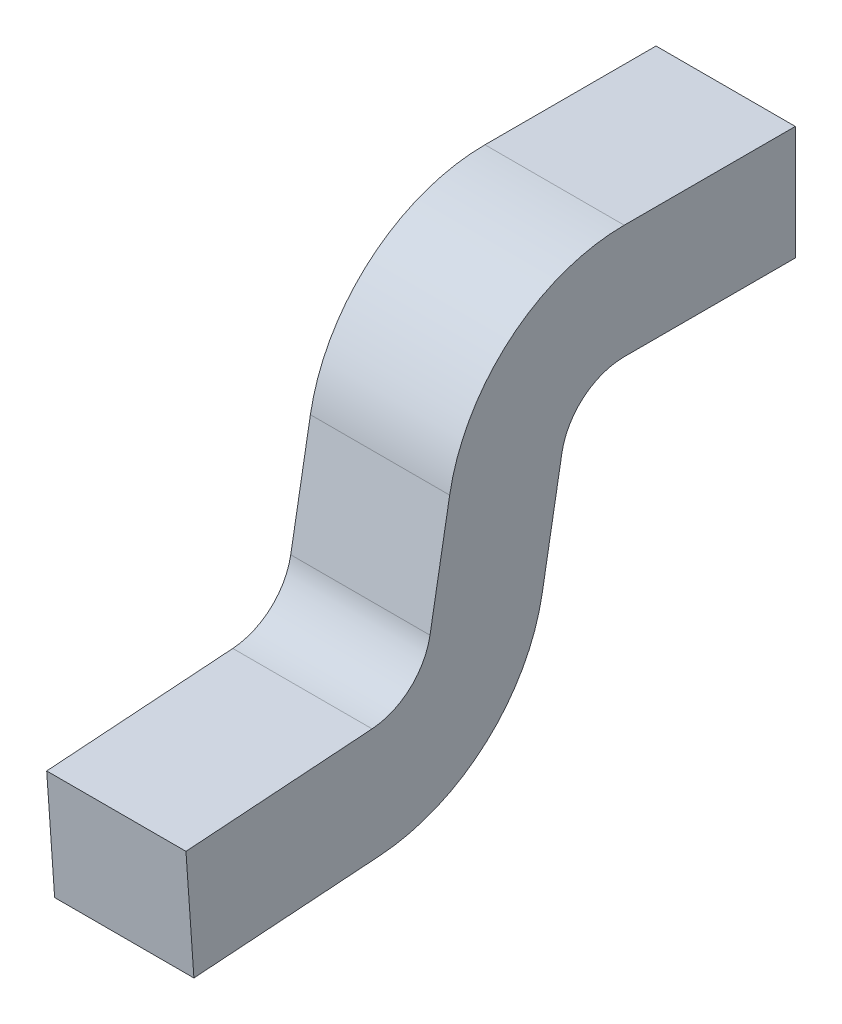
ISO-10303-21;
HEADER;
FILE_DESCRIPTION(('STEP AP214'),'2;1');
FILE_NAME('part.step','',(''),(''),'','','');
FILE_SCHEMA(('AUTOMOTIVE_DESIGN { 1 0 10303 214 1 1 1 1 }'));
ENDSEC;
DATA;
#1=APPLICATION_CONTEXT('core data for automotive mechanical design processes');
#2=APPLICATION_PROTOCOL_DEFINITION('international standard','automotive_design',2000,#1);
#3=PRODUCT_CONTEXT('',#1,'mechanical');
#4=PRODUCT('Part','Part','',(#3));
#5=PRODUCT_RELATED_PRODUCT_CATEGORY('part','',(#4));
#6=PRODUCT_DEFINITION_FORMATION('','',#4);
#7=PRODUCT_DEFINITION_CONTEXT('part definition',#1,'design');
#8=PRODUCT_DEFINITION('design','',#6,#7);
#9=PRODUCT_DEFINITION_SHAPE('','',#8);
#10=(LENGTH_UNIT() NAMED_UNIT(*) SI_UNIT(.MILLI.,.METRE.));
#11=(NAMED_UNIT(*) PLANE_ANGLE_UNIT() SI_UNIT($,.RADIAN.));
#12=(NAMED_UNIT(*) SI_UNIT($,.STERADIAN.) SOLID_ANGLE_UNIT());
#13=UNCERTAINTY_MEASURE_WITH_UNIT(LENGTH_MEASURE(1.E-05),#10,'distance_accuracy_value','');
#14=(GEOMETRIC_REPRESENTATION_CONTEXT(3) GLOBAL_UNCERTAINTY_ASSIGNED_CONTEXT((#13)) GLOBAL_UNIT_ASSIGNED_CONTEXT((#10,
#11,#12)) REPRESENTATION_CONTEXT('',''));
#15=CARTESIAN_POINT('',(0.,0.,0.));
#16=DIRECTION('',(0.,0.,1.));
#17=DIRECTION('',(1.,0.,0.));
#18=AXIS2_PLACEMENT_3D('',#15,#16,#17);
#19=CARTESIAN_POINT('',(-0.11,0.,0.));
#20=DIRECTION('',(1.,0.,0.));
#21=DIRECTION('',(0.,0.,-1.));
#22=AXIS2_PLACEMENT_3D('',#19,#20,#21);
#23=PLANE('',#22);
#24=DIRECTION('',(0.,0.,1.));
#25=VECTOR('',#24,1.);
#26=CARTESIAN_POINT('',(-0.11,0.44,-0.4));
#27=LINE('',#26,#25);
#28=CARTESIAN_POINT('',(-0.11,0.44,-0.4));
#29=VERTEX_POINT('',#28);
#30=CARTESIAN_POINT('',(-0.11,0.44,-0.1297549781019));
#31=VERTEX_POINT('',#30);
#32=EDGE_CURVE('E11',#29,#31,#27,.T.);
#33=ORIENTED_EDGE('',*,*,#32,.F.);
#34=DIRECTION('',(0.,1.,0.));
#35=VECTOR('',#34,1.);
#36=CARTESIAN_POINT('',(-0.11,0.26,-0.4));
#37=LINE('',#36,#35);
#38=CARTESIAN_POINT('',(-0.11,0.26,-0.4));
#39=VERTEX_POINT('',#38);
#40=EDGE_CURVE('E24',#39,#29,#37,.T.);
#41=ORIENTED_EDGE('',*,*,#40,.F.);
#42=DIRECTION('',(0.,0.,-1.));
#43=VECTOR('',#42,1.);
#44=CARTESIAN_POINT('',(-0.11,0.26,-0.1297549781019));
#45=LINE('',#44,#43);
#46=CARTESIAN_POINT('',(-0.11,0.26,-0.1297549781019));
#47=VERTEX_POINT('',#46);
#48=EDGE_CURVE('E198',#47,#39,#45,.T.);
#49=ORIENTED_EDGE('',*,*,#48,.F.);
#50=CARTESIAN_POINT('',(-0.11,0.16,-0.1297549781019));
#51=DIRECTION('',(1.,0.,0.));
#52=DIRECTION('',(0.,1.,0.));
#53=AXIS2_PLACEMENT_3D('',#50,#51,#52);
#54=CIRCLE('',#53,0.1);
#55=CARTESIAN_POINT('',(-0.11,0.1773648177667,-0.03127420280071));
#56=VERTEX_POINT('',#55);
#57=EDGE_CURVE('E195',#47,#56,#54,.T.);
#58=ORIENTED_EDGE('',*,*,#57,.T.);
#59=DIRECTION('',(0.,-0.984807753012213,0.173648177666902));
#60=VECTOR('',#59,1.);
#61=CARTESIAN_POINT('',(-0.11,0.1773648177667,-0.03127420280071));
#62=LINE('',#61,#60);
#63=CARTESIAN_POINT('',(-0.11,0.001255416922297,-0.0002213638754389));
#64=VERTEX_POINT('',#63);
#65=EDGE_CURVE('E192',#56,#64,#62,.T.);
#66=ORIENTED_EDGE('',*,*,#65,.T.);
#67=CARTESIAN_POINT('',(-0.11,0.04987690666904,0.275524806968));
#68=DIRECTION('',(-1.,0.,0.));
#69=DIRECTION('',(0.,-0.173648177666902,-0.984807753012213));
#70=AXIS2_PLACEMENT_3D('',#67,#68,#69);
#71=CIRCLE('',#70,0.28);
#72=CARTESIAN_POINT('',(-0.11,-0.2294410274037,0.2559929943196));
#73=VERTEX_POINT('',#72);
#74=EDGE_CURVE('E189',#64,#73,#71,.T.);
#75=ORIENTED_EDGE('',*,*,#74,.T.);
#76=DIRECTION('',(0.,0.0697564737441317,-0.997564050259824));
#77=VECTOR('',#76,1.);
#78=CARTESIAN_POINT('',(-0.11,-0.25,0.55));
#79=LINE('',#78,#77);
#80=CARTESIAN_POINT('',(-0.11,-0.25,0.55));
#81=VERTEX_POINT('',#80);
#82=EDGE_CURVE('E187',#81,#73,#79,.T.);
#83=ORIENTED_EDGE('',*,*,#82,.F.);
#84=DIRECTION('',(0.,-0.997564050259824,-0.0697564737441317));
#85=VECTOR('',#84,1.);
#86=CARTESIAN_POINT('',(-0.11,-0.07043847095323,0.5625561652739));
#87=LINE('',#86,#85);
#88=CARTESIAN_POINT('',(-0.11,-0.07043847095323,0.5625561652739));
#89=VERTEX_POINT('',#88);
#90=EDGE_CURVE('E185',#89,#81,#87,.T.);
#91=ORIENTED_EDGE('',*,*,#90,.F.);
#92=DIRECTION('',(0.,-0.0697564737441317,0.997564050259824));
#93=VECTOR('',#92,1.);
#94=CARTESIAN_POINT('',(-0.11,-0.04987949835695,0.2685491595936));
#95=LINE('',#94,#93);
#96=CARTESIAN_POINT('',(-0.11,-0.04987949835695,0.2685491595936));
#97=VERTEX_POINT('',#96);
#98=EDGE_CURVE('E183',#97,#89,#95,.T.);
#99=ORIENTED_EDGE('',*,*,#98,.F.);
#100=CARTESIAN_POINT('',(-0.11,0.04987690666904,0.275524806968));
#101=DIRECTION('',(1.,0.,0.));
#102=DIRECTION('',(0.,-0.997564050259824,-0.0697564737441317));
#103=AXIS2_PLACEMENT_3D('',#100,#101,#102);
#104=CIRCLE('',#103,0.1);
#105=CARTESIAN_POINT('',(-0.11,0.03251208890234,0.1770440316668));
#106=VERTEX_POINT('',#105);
#107=EDGE_CURVE('E181',#97,#106,#104,.T.);
#108=ORIENTED_EDGE('',*,*,#107,.T.);
#109=DIRECTION('',(0.,0.984807753012213,-0.173648177666902));
#110=VECTOR('',#109,1.);
#111=CARTESIAN_POINT('',(-0.11,0.03251208890234,0.1770440316668));
#112=LINE('',#111,#110);
#113=CARTESIAN_POINT('',(-0.11,0.2086214897467,0.1459911927415));
#114=VERTEX_POINT('',#113);
#115=EDGE_CURVE('E110',#106,#114,#112,.T.);
#116=ORIENTED_EDGE('',*,*,#115,.T.);
#117=CARTESIAN_POINT('',(-0.11,0.16,-0.1297549781019));
#118=DIRECTION('',(-1.,0.,0.));
#119=DIRECTION('',(0.,0.173648177666902,0.984807753012213));
#120=AXIS2_PLACEMENT_3D('',#117,#118,#119);
#121=CIRCLE('',#120,0.28);
#122=EDGE_CURVE('E37',#114,#31,#121,.T.);
#123=ORIENTED_EDGE('',*,*,#122,.T.);
#124=EDGE_LOOP('',(#33,#41,#49,#58,#66,#75,#83,#91,#99,#108,#116,#123));
#125=FACE_BOUND('',#124,.T.);
#126=ADVANCED_FACE('F17',(#125),#23,.F.);
#127=CARTESIAN_POINT('',(0.468936,0.16,-0.1297549781019));
#128=DIRECTION('',(-1.,0.,0.));
#129=DIRECTION('',(0.,0.173648177666902,0.984807753012213));
#130=AXIS2_PLACEMENT_3D('',#127,#128,#129);
#131=CYLINDRICAL_SURFACE('',#130,0.28);
#132=DIRECTION('',(-1.,0.,0.));
#133=VECTOR('',#132,1.);
#134=CARTESIAN_POINT('',(0.11,0.2086214897467,0.1459911927415));
#135=LINE('',#134,#133);
#136=CARTESIAN_POINT('',(0.11,0.2086214897467,0.1459911927415));
#137=VERTEX_POINT('',#136);
#138=EDGE_CURVE('E177',#137,#114,#135,.T.);
#139=ORIENTED_EDGE('',*,*,#138,.F.);
#140=CARTESIAN_POINT('',(0.11,0.16,-0.1297549781019));
#141=DIRECTION('',(1.,0.,0.));
#142=DIRECTION('',(0.,1.,0.));
#143=AXIS2_PLACEMENT_3D('',#140,#141,#142);
#144=CIRCLE('',#143,0.28);
#145=CARTESIAN_POINT('',(0.11,0.44,-0.1297549781019));
#146=VERTEX_POINT('',#145);
#147=EDGE_CURVE('E126',#146,#137,#144,.T.);
#148=ORIENTED_EDGE('',*,*,#147,.F.);
#149=DIRECTION('',(-1.,0.,0.));
#150=VECTOR('',#149,1.);
#151=CARTESIAN_POINT('',(0.11,0.44,-0.1297549781019));
#152=LINE('',#151,#150);
#153=EDGE_CURVE('E173',#146,#31,#152,.T.);
#154=ORIENTED_EDGE('',*,*,#153,.T.);
#155=ORIENTED_EDGE('',*,*,#122,.F.);
#156=EDGE_LOOP('',(#139,#148,#154,#155));
#157=FACE_BOUND('',#156,.T.);
#158=ADVANCED_FACE('F241',(#157),#131,.T.);
#159=CARTESIAN_POINT('',(-0.11,0.44,-0.4));
#160=DIRECTION('',(0.,1.,0.));
#161=DIRECTION('',(0.,0.,1.));
#162=AXIS2_PLACEMENT_3D('',#159,#160,#161);
#163=PLANE('',#162);
#164=DIRECTION('',(0.,0.,1.));
#165=VECTOR('',#164,1.);
#166=CARTESIAN_POINT('',(0.11,0.44,-0.4));
#167=LINE('',#166,#165);
#168=CARTESIAN_POINT('',(0.11,0.44,-0.4));
#169=VERTEX_POINT('',#168);
#170=EDGE_CURVE('E171',#169,#146,#167,.T.);
#171=ORIENTED_EDGE('',*,*,#170,.F.);
#172=DIRECTION('',(1.,0.,0.));
#173=VECTOR('',#172,1.);
#174=CARTESIAN_POINT('',(-0.11,0.44,-0.4));
#175=LINE('',#174,#173);
#176=EDGE_CURVE('E169',#29,#169,#175,.T.);
#177=ORIENTED_EDGE('',*,*,#176,.F.);
#178=ORIENTED_EDGE('',*,*,#32,.T.);
#179=ORIENTED_EDGE('',*,*,#153,.F.);
#180=EDGE_LOOP('',(#171,#177,#178,#179));
#181=FACE_BOUND('',#180,.T.);
#182=ADVANCED_FACE('F245',(#181),#163,.T.);
#183=CARTESIAN_POINT('',(-0.11,0.26,-0.4));
#184=DIRECTION('',(0.,0.,-1.));
#185=DIRECTION('',(0.,1.,0.));
#186=AXIS2_PLACEMENT_3D('',#183,#184,#185);
#187=PLANE('',#186);
#188=ORIENTED_EDGE('',*,*,#176,.T.);
#189=DIRECTION('',(0.,1.,0.));
#190=VECTOR('',#189,1.);
#191=CARTESIAN_POINT('',(0.11,0.26,-0.4));
#192=LINE('',#191,#190);
#193=CARTESIAN_POINT('',(0.11,0.26,-0.4));
#194=VERTEX_POINT('',#193);
#195=EDGE_CURVE('E166',#194,#169,#192,.T.);
#196=ORIENTED_EDGE('',*,*,#195,.F.);
#197=DIRECTION('',(1.,0.,0.));
#198=VECTOR('',#197,1.);
#199=CARTESIAN_POINT('',(-0.11,0.26,-0.4));
#200=LINE('',#199,#198);
#201=EDGE_CURVE('E164',#39,#194,#200,.T.);
#202=ORIENTED_EDGE('',*,*,#201,.F.);
#203=ORIENTED_EDGE('',*,*,#40,.T.);
#204=EDGE_LOOP('',(#188,#196,#202,#203));
#205=FACE_BOUND('',#204,.T.);
#206=ADVANCED_FACE('F205',(#205),#187,.T.);
#207=CARTESIAN_POINT('',(-0.11,0.26,-0.0458450149842));
#208=DIRECTION('',(0.,-1.,0.));
#209=DIRECTION('',(0.,0.,-1.));
#210=AXIS2_PLACEMENT_3D('',#207,#208,#209);
#211=PLANE('',#210);
#212=ORIENTED_EDGE('',*,*,#48,.T.);
#213=ORIENTED_EDGE('',*,*,#201,.T.);
#214=DIRECTION('',(0.,0.,-1.));
#215=VECTOR('',#214,1.);
#216=CARTESIAN_POINT('',(0.11,0.26,-0.1297549781019));
#217=LINE('',#216,#215);
#218=CARTESIAN_POINT('',(0.11,0.26,-0.1297549781019));
#219=VERTEX_POINT('',#218);
#220=EDGE_CURVE('E161',#219,#194,#217,.T.);
#221=ORIENTED_EDGE('',*,*,#220,.F.);
#222=DIRECTION('',(-1.,0.,0.));
#223=VECTOR('',#222,1.);
#224=CARTESIAN_POINT('',(0.11,0.26,-0.1297549781019));
#225=LINE('',#224,#223);
#226=EDGE_CURVE('E158',#219,#47,#225,.T.);
#227=ORIENTED_EDGE('',*,*,#226,.T.);
#228=EDGE_LOOP('',(#212,#213,#221,#227));
#229=FACE_BOUND('',#228,.T.);
#230=ADVANCED_FACE('F201',(#229),#211,.T.);
#231=CARTESIAN_POINT('',(0.396792,0.16,-0.1297549781019));
#232=DIRECTION('',(-1.,0.,0.));
#233=DIRECTION('',(0.,0.173648177666902,0.984807753012213));
#234=AXIS2_PLACEMENT_3D('',#231,#232,#233);
#235=CYLINDRICAL_SURFACE('',#234,0.1);
#236=ORIENTED_EDGE('',*,*,#57,.F.);
#237=ORIENTED_EDGE('',*,*,#226,.F.);
#238=CARTESIAN_POINT('',(0.11,0.16,-0.1297549781019));
#239=DIRECTION('',(-1.,0.,0.));
#240=DIRECTION('',(0.,0.173648177666902,0.984807753012213));
#241=AXIS2_PLACEMENT_3D('',#238,#239,#240);
#242=CIRCLE('',#241,0.1);
#243=CARTESIAN_POINT('',(0.11,0.1773648177667,-0.03127420280071));
#244=VERTEX_POINT('',#243);
#245=EDGE_CURVE('E155',#244,#219,#242,.T.);
#246=ORIENTED_EDGE('',*,*,#245,.F.);
#247=DIRECTION('',(-1.,0.,0.));
#248=VECTOR('',#247,1.);
#249=CARTESIAN_POINT('',(0.11,0.1773648177667,-0.03127420280071));
#250=LINE('',#249,#248);
#251=EDGE_CURVE('E152',#244,#56,#250,.T.);
#252=ORIENTED_EDGE('',*,*,#251,.T.);
#253=EDGE_LOOP('',(#236,#237,#246,#252));
#254=FACE_BOUND('',#253,.T.);
#255=ADVANCED_FACE('F211',(#254),#235,.F.);
#256=CARTESIAN_POINT('',(-0.11,-0.2141811029219,0.03776590720303));
#257=DIRECTION('',(0.,-0.173648177666902,-0.984807753012213));
#258=DIRECTION('',(0.,0.984807753012213,-0.173648177666902));
#259=AXIS2_PLACEMENT_3D('',#256,#257,#258);
#260=PLANE('',#259);
#261=DIRECTION('',(0.,0.984807753012213,-0.173648177666902));
#262=VECTOR('',#261,1.);
#263=CARTESIAN_POINT('',(0.11,0.001255416922297,-0.0002213638754389));
#264=LINE('',#263,#262);
#265=CARTESIAN_POINT('',(0.11,0.001255416922297,-0.0002213638754389));
#266=VERTEX_POINT('',#265);
#267=EDGE_CURVE('E149',#266,#244,#264,.T.);
#268=ORIENTED_EDGE('',*,*,#267,.F.);
#269=DIRECTION('',(1.,0.,0.));
#270=VECTOR('',#269,1.);
#271=CARTESIAN_POINT('',(-0.11,0.001255416922297,-0.0002213638754389));
#272=LINE('',#271,#270);
#273=EDGE_CURVE('E147',#64,#266,#272,.T.);
#274=ORIENTED_EDGE('',*,*,#273,.F.);
#275=ORIENTED_EDGE('',*,*,#65,.F.);
#276=ORIENTED_EDGE('',*,*,#251,.F.);
#277=EDGE_LOOP('',(#268,#274,#275,#276));
#278=FACE_BOUND('',#277,.T.);
#279=ADVANCED_FACE('F216',(#278),#260,.T.);
#280=CARTESIAN_POINT('',(-0.11,0.04987690666904,0.275524806968));
#281=DIRECTION('',(-1.,0.,0.));
#282=DIRECTION('',(0.,-0.173648177666902,-0.984807753012213));
#283=AXIS2_PLACEMENT_3D('',#280,#281,#282);
#284=CYLINDRICAL_SURFACE('',#283,0.28);
#285=CARTESIAN_POINT('',(0.11,0.04987690666904,0.275524806968));
#286=DIRECTION('',(-1.,0.,0.));
#287=DIRECTION('',(0.,-0.173648177666902,-0.984807753012213));
#288=AXIS2_PLACEMENT_3D('',#285,#286,#287);
#289=CIRCLE('',#288,0.28);
#290=CARTESIAN_POINT('',(0.11,-0.2294410274037,0.2559929943196));
#291=VERTEX_POINT('',#290);
#292=EDGE_CURVE('E145',#266,#291,#289,.T.);
#293=ORIENTED_EDGE('',*,*,#292,.T.);
#294=DIRECTION('',(1.,0.,0.));
#295=VECTOR('',#294,1.);
#296=CARTESIAN_POINT('',(-0.11,-0.2294410274037,0.2559929943196));
#297=LINE('',#296,#295);
#298=EDGE_CURVE('E142',#73,#291,#297,.T.);
#299=ORIENTED_EDGE('',*,*,#298,.F.);
#300=ORIENTED_EDGE('',*,*,#74,.F.);
#301=ORIENTED_EDGE('',*,*,#273,.T.);
#302=EDGE_LOOP('',(#293,#299,#300,#301));
#303=FACE_BOUND('',#302,.T.);
#304=ADVANCED_FACE('F218',(#303),#284,.T.);
#305=CARTESIAN_POINT('',(-0.11,-0.25,0.55));
#306=DIRECTION('',(0.,-0.997564050259824,-0.0697564737441317));
#307=DIRECTION('',(0.,0.0697564737441317,-0.997564050259824));
#308=AXIS2_PLACEMENT_3D('',#305,#306,#307);
#309=PLANE('',#308);
#310=ORIENTED_EDGE('',*,*,#298,.T.);
#311=DIRECTION('',(0.,0.0697564737441317,-0.997564050259824));
#312=VECTOR('',#311,1.);
#313=CARTESIAN_POINT('',(0.11,-0.25,0.55));
#314=LINE('',#313,#312);
#315=CARTESIAN_POINT('',(0.11,-0.25,0.55));
#316=VERTEX_POINT('',#315);
#317=EDGE_CURVE('E139',#316,#291,#314,.T.);
#318=ORIENTED_EDGE('',*,*,#317,.F.);
#319=DIRECTION('',(1.,0.,0.));
#320=VECTOR('',#319,1.);
#321=CARTESIAN_POINT('',(-0.11,-0.25,0.55));
#322=LINE('',#321,#320);
#323=EDGE_CURVE('E137',#81,#316,#322,.T.);
#324=ORIENTED_EDGE('',*,*,#323,.F.);
#325=ORIENTED_EDGE('',*,*,#82,.T.);
#326=EDGE_LOOP('',(#310,#318,#324,#325));
#327=FACE_BOUND('',#326,.T.);
#328=ADVANCED_FACE('F221',(#327),#309,.T.);
#329=CARTESIAN_POINT('',(-0.11,-0.07043847095323,0.5625561652739));
#330=DIRECTION('',(0.,-0.0697564737441317,0.997564050259824));
#331=DIRECTION('',(0.,-0.997564050259824,-0.0697564737441317));
#332=AXIS2_PLACEMENT_3D('',#329,#330,#331);
#333=PLANE('',#332);
#334=ORIENTED_EDGE('',*,*,#323,.T.);
#335=DIRECTION('',(0.,-0.997564050259824,-0.0697564737441317));
#336=VECTOR('',#335,1.);
#337=CARTESIAN_POINT('',(0.11,-0.07043847095323,0.5625561652739));
#338=LINE('',#337,#336);
#339=CARTESIAN_POINT('',(0.11,-0.07043847095323,0.5625561652739));
#340=VERTEX_POINT('',#339);
#341=EDGE_CURVE('E134',#340,#316,#338,.T.);
#342=ORIENTED_EDGE('',*,*,#341,.F.);
#343=DIRECTION('',(1.,0.,0.));
#344=VECTOR('',#343,1.);
#345=CARTESIAN_POINT('',(-0.11,-0.07043847095323,0.5625561652739));
#346=LINE('',#345,#344);
#347=EDGE_CURVE('E132',#89,#340,#346,.T.);
#348=ORIENTED_EDGE('',*,*,#347,.F.);
#349=ORIENTED_EDGE('',*,*,#90,.T.);
#350=EDGE_LOOP('',(#334,#342,#348,#349));
#351=FACE_BOUND('',#350,.T.);
#352=ADVANCED_FACE('F228',(#351),#333,.T.);
#353=CARTESIAN_POINT('',(-0.11,-0.04442952532774,0.1906109141948));
#354=DIRECTION('',(0.,0.997564050259824,0.0697564737441317));
#355=DIRECTION('',(0.,-0.0697564737441317,0.997564050259824));
#356=AXIS2_PLACEMENT_3D('',#353,#354,#355);
#357=PLANE('',#356);
#358=ORIENTED_EDGE('',*,*,#347,.T.);
#359=DIRECTION('',(0.,-0.0697564737441317,0.997564050259824));
#360=VECTOR('',#359,1.);
#361=CARTESIAN_POINT('',(0.11,-0.04987949835695,0.2685491595936));
#362=LINE('',#361,#360);
#363=CARTESIAN_POINT('',(0.11,-0.04987949835695,0.2685491595936));
#364=VERTEX_POINT('',#363);
#365=EDGE_CURVE('E130',#364,#340,#362,.T.);
#366=ORIENTED_EDGE('',*,*,#365,.F.);
#367=DIRECTION('',(1.,0.,0.));
#368=VECTOR('',#367,1.);
#369=CARTESIAN_POINT('',(-0.11,-0.04987949835695,0.2685491595936));
#370=LINE('',#369,#368);
#371=EDGE_CURVE('E118',#97,#364,#370,.T.);
#372=ORIENTED_EDGE('',*,*,#371,.F.);
#373=ORIENTED_EDGE('',*,*,#98,.T.);
#374=EDGE_LOOP('',(#358,#366,#372,#373));
#375=FACE_BOUND('',#374,.T.);
#376=ADVANCED_FACE('F230',(#375),#357,.T.);
#377=CARTESIAN_POINT('',(-0.11,0.04987690666904,0.275524806968));
#378=DIRECTION('',(1.,0.,0.));
#379=DIRECTION('',(0.,-0.997564050259824,-0.0697564737441317));
#380=AXIS2_PLACEMENT_3D('',#377,#378,#379);
#381=CYLINDRICAL_SURFACE('',#380,0.1);
#382=CARTESIAN_POINT('',(0.11,0.04987690666904,0.275524806968));
#383=DIRECTION('',(1.,0.,0.));
#384=DIRECTION('',(0.,-0.997564050259824,-0.0697564737441317));
#385=AXIS2_PLACEMENT_3D('',#382,#383,#384);
#386=CIRCLE('',#385,0.1);
#387=CARTESIAN_POINT('',(0.11,0.03251208890234,0.1770440316668));
#388=VERTEX_POINT('',#387);
#389=EDGE_CURVE('E113',#364,#388,#386,.T.);
#390=ORIENTED_EDGE('',*,*,#389,.T.);
#391=DIRECTION('',(1.,0.,0.));
#392=VECTOR('',#391,1.);
#393=CARTESIAN_POINT('',(-0.11,0.03251208890234,0.1770440316668));
#394=LINE('',#393,#392);
#395=EDGE_CURVE('E104',#106,#388,#394,.T.);
#396=ORIENTED_EDGE('',*,*,#395,.F.);
#397=ORIENTED_EDGE('',*,*,#107,.F.);
#398=ORIENTED_EDGE('',*,*,#371,.T.);
#399=EDGE_LOOP('',(#390,#396,#397,#398));
#400=FACE_BOUND('',#399,.T.);
#401=ADVANCED_FACE('F116',(#400),#381,.F.);
#402=CARTESIAN_POINT('',(-0.11,0.03125667198005,0.1772653955422));
#403=DIRECTION('',(0.,0.173648177666902,0.984807753012213));
#404=DIRECTION('',(0.,-0.984807753012213,0.173648177666902));
#405=AXIS2_PLACEMENT_3D('',#402,#403,#404);
#406=PLANE('',#405);
#407=ORIENTED_EDGE('',*,*,#115,.F.);
#408=ORIENTED_EDGE('',*,*,#395,.T.);
#409=DIRECTION('',(0.,-0.984807753012213,0.173648177666902));
#410=VECTOR('',#409,1.);
#411=CARTESIAN_POINT('',(0.11,0.2086214897467,0.1459911927415));
#412=LINE('',#411,#410);
#413=EDGE_CURVE('E109',#137,#388,#412,.T.);
#414=ORIENTED_EDGE('',*,*,#413,.F.);
#415=ORIENTED_EDGE('',*,*,#138,.T.);
#416=EDGE_LOOP('',(#407,#408,#414,#415));
#417=FACE_BOUND('',#416,.T.);
#418=ADVANCED_FACE('F106',(#417),#406,.T.);
#419=CARTESIAN_POINT('',(0.11,0.,0.));
#420=DIRECTION('',(1.,0.,0.));
#421=DIRECTION('',(0.,0.,-1.));
#422=AXIS2_PLACEMENT_3D('',#419,#420,#421);
#423=PLANE('',#422);
#424=ORIENTED_EDGE('',*,*,#413,.T.);
#425=ORIENTED_EDGE('',*,*,#389,.F.);
#426=ORIENTED_EDGE('',*,*,#365,.T.);
#427=ORIENTED_EDGE('',*,*,#341,.T.);
#428=ORIENTED_EDGE('',*,*,#317,.T.);
#429=ORIENTED_EDGE('',*,*,#292,.F.);
#430=ORIENTED_EDGE('',*,*,#267,.T.);
#431=ORIENTED_EDGE('',*,*,#245,.T.);
#432=ORIENTED_EDGE('',*,*,#220,.T.);
#433=ORIENTED_EDGE('',*,*,#195,.T.);
#434=ORIENTED_EDGE('',*,*,#170,.T.);
#435=ORIENTED_EDGE('',*,*,#147,.T.);
#436=EDGE_LOOP('',(#424,#425,#426,#427,#428,#429,#430,#431,#432,#433,#434,#435));
#437=FACE_BOUND('',#436,.T.);
#438=ADVANCED_FACE('F124',(#437),#423,.T.);
#439=CLOSED_SHELL('',(#126,#158,#182,#206,#230,#255,#279,#304,#328,#352,#376,#401,#418,#438));
#440=MANIFOLD_SOLID_BREP('B1',#439);
#441=ADVANCED_BREP_SHAPE_REPRESENTATION('',(#18,#440),#14);
#442=SHAPE_DEFINITION_REPRESENTATION(#9,#441);
ENDSEC;
END-ISO-10303-21;
